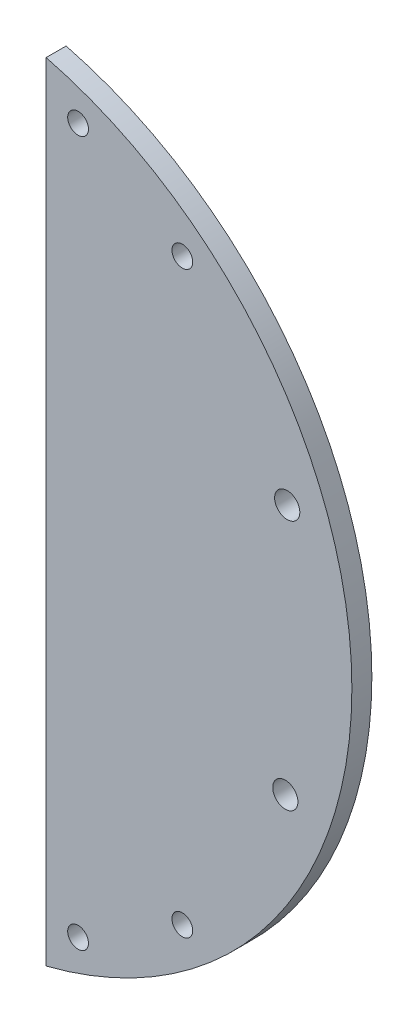
ISO-10303-21;
HEADER;
FILE_DESCRIPTION(('STEP AP214'),'2;1');
FILE_NAME('part.step','',(''),(''),'','','');
FILE_SCHEMA(('AUTOMOTIVE_DESIGN { 1 0 10303 214 1 1 1 1 }'));
ENDSEC;
DATA;
#1=APPLICATION_CONTEXT('core data for automotive mechanical design processes');
#2=APPLICATION_PROTOCOL_DEFINITION('international standard','automotive_design',2000,#1);
#3=PRODUCT_CONTEXT('',#1,'mechanical');
#4=PRODUCT('Part','Part','',(#3));
#5=PRODUCT_RELATED_PRODUCT_CATEGORY('part','',(#4));
#6=PRODUCT_DEFINITION_FORMATION('','',#4);
#7=PRODUCT_DEFINITION_CONTEXT('part definition',#1,'design');
#8=PRODUCT_DEFINITION('design','',#6,#7);
#9=PRODUCT_DEFINITION_SHAPE('','',#8);
#10=(LENGTH_UNIT() NAMED_UNIT(*) SI_UNIT(.MILLI.,.METRE.));
#11=(NAMED_UNIT(*) PLANE_ANGLE_UNIT() SI_UNIT($,.RADIAN.));
#12=(NAMED_UNIT(*) SI_UNIT($,.STERADIAN.) SOLID_ANGLE_UNIT());
#13=UNCERTAINTY_MEASURE_WITH_UNIT(LENGTH_MEASURE(1.E-05),#10,'distance_accuracy_value','');
#14=(GEOMETRIC_REPRESENTATION_CONTEXT(3) GLOBAL_UNCERTAINTY_ASSIGNED_CONTEXT((#13)) GLOBAL_UNIT_ASSIGNED_CONTEXT((#10,
#11,#12)) REPRESENTATION_CONTEXT('',''));
#15=CARTESIAN_POINT('',(0.,0.,0.));
#16=DIRECTION('',(0.,0.,1.));
#17=DIRECTION('',(1.,0.,0.));
#18=AXIS2_PLACEMENT_3D('',#15,#16,#17);
#19=CARTESIAN_POINT('',(-15.925,-0.366425757688034,3.175));
#20=DIRECTION('',(0.,0.,1.));
#21=DIRECTION('',(1.,0.,0.));
#22=AXIS2_PLACEMENT_3D('',#19,#20,#21);
#23=PLANE('',#22);
#24=CARTESIAN_POINT('',(5.075,55.633574242312,3.175));
#25=DIRECTION('',(0.,0.,1.));
#26=DIRECTION('',(-1.,0.,0.));
#27=AXIS2_PLACEMENT_3D('',#24,#25,#26);
#28=CIRCLE('',#27,1.65);
#29=CARTESIAN_POINT('',(3.425,55.633574242312,3.175));
#30=VERTEX_POINT('',#29);
#31=EDGE_CURVE('E96',#30,#30,#28,.T.);
#32=ORIENTED_EDGE('',*,*,#31,.F.);
#33=EDGE_LOOP('',(#32));
#34=FACE_BOUND('',#33,.T.);
#35=CARTESIAN_POINT('',(21.6384711955131,-46.366425757688,3.175));
#36=DIRECTION('',(0.,0.,1.));
#37=DIRECTION('',(1.,0.,0.));
#38=AXIS2_PLACEMENT_3D('',#35,#36,#37);
#39=CIRCLE('',#38,1.65);
#40=CARTESIAN_POINT('',(23.2884711955131,-46.366425757688,3.175));
#41=VERTEX_POINT('',#40);
#42=EDGE_CURVE('E84',#41,#41,#39,.T.);
#43=ORIENTED_EDGE('',*,*,#42,.F.);
#44=EDGE_LOOP('',(#43));
#45=FACE_BOUND('',#44,.T.);
#46=CARTESIAN_POINT('',(38.,-20.2872222283984,3.175));
#47=DIRECTION('',(0.,0.,1.));
#48=DIRECTION('',(1.,0.,0.));
#49=AXIS2_PLACEMENT_3D('',#46,#47,#48);
#50=CIRCLE('',#49,2.);
#51=CARTESIAN_POINT('',(40.,-20.2872222283984,3.175));
#52=VERTEX_POINT('',#51);
#53=EDGE_CURVE('E70',#52,#52,#50,.T.);
#54=ORIENTED_EDGE('',*,*,#53,.F.);
#55=EDGE_LOOP('',(#54));
#56=FACE_BOUND('',#55,.T.);
#57=CARTESIAN_POINT('',(-15.925,-0.366425757688034,3.175));
#58=DIRECTION('',(0.,0.,1.));
#59=DIRECTION('',(1.,0.,0.));
#60=AXIS2_PLACEMENT_3D('',#57,#58,#59);
#61=CIRCLE('',#60,64.5);
#62=CARTESIAN_POINT('',(0.,-62.8695806780598,3.175));
#63=VERTEX_POINT('',#62);
#64=CARTESIAN_POINT('',(0.,62.1367291626838,3.175));
#65=VERTEX_POINT('',#64);
#66=EDGE_CURVE('E64',#63,#65,#61,.T.);
#67=ORIENTED_EDGE('',*,*,#66,.T.);
#68=DIRECTION('',(0.,-1.,0.));
#69=VECTOR('',#68,1.);
#70=CARTESIAN_POINT('',(0.,62.1367291626838,3.175));
#71=LINE('',#70,#69);
#72=EDGE_CURVE('E49',#65,#63,#71,.T.);
#73=ORIENTED_EDGE('',*,*,#72,.T.);
#74=EDGE_LOOP('',(#67,#73));
#75=FACE_BOUND('',#74,.T.);
#76=CARTESIAN_POINT('',(38.3017316170882,19.7116397308029,3.175));
#77=DIRECTION('',(0.,0.,1.));
#78=DIRECTION('',(-1.,0.,0.));
#79=AXIS2_PLACEMENT_3D('',#76,#77,#78);
#80=CIRCLE('',#79,1.99999999999999);
#81=CARTESIAN_POINT('',(36.3017316170882,19.7116397308029,3.175));
#82=VERTEX_POINT('',#81);
#83=EDGE_CURVE('E79',#82,#82,#80,.T.);
#84=ORIENTED_EDGE('',*,*,#83,.F.);
#85=EDGE_LOOP('',(#84));
#86=FACE_BOUND('',#85,.T.);
#87=CARTESIAN_POINT('',(5.07500000000001,-56.366425757688,3.175));
#88=DIRECTION('',(0.,0.,1.));
#89=DIRECTION('',(1.,0.,0.));
#90=AXIS2_PLACEMENT_3D('',#87,#88,#89);
#91=CIRCLE('',#90,1.65);
#92=CARTESIAN_POINT('',(6.72500000000001,-56.366425757688,3.175));
#93=VERTEX_POINT('',#92);
#94=EDGE_CURVE('E90',#93,#93,#91,.T.);
#95=ORIENTED_EDGE('',*,*,#94,.F.);
#96=EDGE_LOOP('',(#95));
#97=FACE_BOUND('',#96,.T.);
#98=CARTESIAN_POINT('',(21.6384711955131,45.633574242312,3.175));
#99=DIRECTION('',(0.,0.,1.));
#100=DIRECTION('',(-1.,0.,0.));
#101=AXIS2_PLACEMENT_3D('',#98,#99,#100);
#102=CIRCLE('',#101,1.65);
#103=CARTESIAN_POINT('',(19.9884711955131,45.633574242312,3.175));
#104=VERTEX_POINT('',#103);
#105=EDGE_CURVE('E102',#104,#104,#102,.T.);
#106=ORIENTED_EDGE('',*,*,#105,.F.);
#107=EDGE_LOOP('',(#106));
#108=FACE_BOUND('',#107,.T.);
#109=ADVANCED_FACE('F33',(#34,#45,#56,#75,#86,#97,#108),#23,.T.);
#110=CARTESIAN_POINT('',(-15.925,-0.366425757688034,0.));
#111=DIRECTION('',(0.,0.,1.));
#112=DIRECTION('',(1.,0.,0.));
#113=AXIS2_PLACEMENT_3D('',#110,#111,#112);
#114=PLANE('',#113);
#115=CARTESIAN_POINT('',(-15.925,-0.366425757688034,0.));
#116=DIRECTION('',(0.,0.,1.));
#117=DIRECTION('',(1.,0.,0.));
#118=AXIS2_PLACEMENT_3D('',#115,#116,#117);
#119=CIRCLE('',#118,64.5);
#120=CARTESIAN_POINT('',(0.,-62.8695806780598,0.));
#121=VERTEX_POINT('',#120);
#122=CARTESIAN_POINT('',(0.,62.1367291626838,0.));
#123=VERTEX_POINT('',#122);
#124=EDGE_CURVE('E65',#121,#123,#119,.T.);
#125=ORIENTED_EDGE('',*,*,#124,.F.);
#126=DIRECTION('',(0.,-1.,0.));
#127=VECTOR('',#126,1.);
#128=CARTESIAN_POINT('',(0.,62.1367291626838,0.));
#129=LINE('',#128,#127);
#130=EDGE_CURVE('E57',#123,#121,#129,.T.);
#131=ORIENTED_EDGE('',*,*,#130,.F.);
#132=EDGE_LOOP('',(#125,#131));
#133=FACE_BOUND('',#132,.T.);
#134=CARTESIAN_POINT('',(38.,-20.2872222283984,0.));
#135=DIRECTION('',(0.,0.,1.));
#136=DIRECTION('',(1.,0.,0.));
#137=AXIS2_PLACEMENT_3D('',#134,#135,#136);
#138=CIRCLE('',#137,2.);
#139=CARTESIAN_POINT('',(40.,-20.2872222283984,0.));
#140=VERTEX_POINT('',#139);
#141=EDGE_CURVE('E73',#140,#140,#138,.T.);
#142=ORIENTED_EDGE('',*,*,#141,.T.);
#143=EDGE_LOOP('',(#142));
#144=FACE_BOUND('',#143,.T.);
#145=CARTESIAN_POINT('',(38.3017316170882,19.7116397308029,0.));
#146=DIRECTION('',(0.,0.,1.));
#147=DIRECTION('',(-1.,0.,0.));
#148=AXIS2_PLACEMENT_3D('',#145,#146,#147);
#149=CIRCLE('',#148,1.99999999999999);
#150=CARTESIAN_POINT('',(36.3017316170882,19.7116397308029,0.));
#151=VERTEX_POINT('',#150);
#152=EDGE_CURVE('E81',#151,#151,#149,.T.);
#153=ORIENTED_EDGE('',*,*,#152,.T.);
#154=EDGE_LOOP('',(#153));
#155=FACE_BOUND('',#154,.T.);
#156=CARTESIAN_POINT('',(21.6384711955131,-46.366425757688,0.));
#157=DIRECTION('',(0.,0.,1.));
#158=DIRECTION('',(1.,0.,0.));
#159=AXIS2_PLACEMENT_3D('',#156,#157,#158);
#160=CIRCLE('',#159,1.65);
#161=CARTESIAN_POINT('',(23.2884711955131,-46.366425757688,0.));
#162=VERTEX_POINT('',#161);
#163=EDGE_CURVE('E87',#162,#162,#160,.T.);
#164=ORIENTED_EDGE('',*,*,#163,.T.);
#165=EDGE_LOOP('',(#164));
#166=FACE_BOUND('',#165,.T.);
#167=CARTESIAN_POINT('',(5.07500000000001,-56.366425757688,0.));
#168=DIRECTION('',(0.,0.,1.));
#169=DIRECTION('',(1.,0.,0.));
#170=AXIS2_PLACEMENT_3D('',#167,#168,#169);
#171=CIRCLE('',#170,1.65);
#172=CARTESIAN_POINT('',(6.72500000000001,-56.366425757688,0.));
#173=VERTEX_POINT('',#172);
#174=EDGE_CURVE('E93',#173,#173,#171,.T.);
#175=ORIENTED_EDGE('',*,*,#174,.T.);
#176=EDGE_LOOP('',(#175));
#177=FACE_BOUND('',#176,.T.);
#178=CARTESIAN_POINT('',(5.075,55.633574242312,0.));
#179=DIRECTION('',(0.,0.,1.));
#180=DIRECTION('',(-1.,0.,0.));
#181=AXIS2_PLACEMENT_3D('',#178,#179,#180);
#182=CIRCLE('',#181,1.65);
#183=CARTESIAN_POINT('',(3.425,55.633574242312,0.));
#184=VERTEX_POINT('',#183);
#185=EDGE_CURVE('E99',#184,#184,#182,.T.);
#186=ORIENTED_EDGE('',*,*,#185,.T.);
#187=EDGE_LOOP('',(#186));
#188=FACE_BOUND('',#187,.T.);
#189=CARTESIAN_POINT('',(21.6384711955131,45.633574242312,0.));
#190=DIRECTION('',(0.,0.,1.));
#191=DIRECTION('',(-1.,0.,0.));
#192=AXIS2_PLACEMENT_3D('',#189,#190,#191);
#193=CIRCLE('',#192,1.65);
#194=CARTESIAN_POINT('',(19.9884711955131,45.633574242312,0.));
#195=VERTEX_POINT('',#194);
#196=EDGE_CURVE('E105',#195,#195,#193,.T.);
#197=ORIENTED_EDGE('',*,*,#196,.T.);
#198=EDGE_LOOP('',(#197));
#199=FACE_BOUND('',#198,.T.);
#200=ADVANCED_FACE('F68',(#133,#144,#155,#166,#177,#188,#199),#114,.F.);
#201=CARTESIAN_POINT('',(-15.925,-0.366425757688034,3.175));
#202=DIRECTION('',(0.,0.,-1.));
#203=DIRECTION('',(-1.,0.,0.));
#204=AXIS2_PLACEMENT_3D('',#201,#202,#203);
#205=CYLINDRICAL_SURFACE('',#204,64.5);
#206=ORIENTED_EDGE('',*,*,#124,.T.);
#207=DIRECTION('',(0.,0.,-1.));
#208=VECTOR('',#207,1.);
#209=CARTESIAN_POINT('',(0.,62.1367291626838,3.175));
#210=LINE('',#209,#208);
#211=EDGE_CURVE('E11',#65,#123,#210,.T.);
#212=ORIENTED_EDGE('',*,*,#211,.F.);
#213=ORIENTED_EDGE('',*,*,#66,.F.);
#214=DIRECTION('',(0.,0.,-1.));
#215=VECTOR('',#214,1.);
#216=CARTESIAN_POINT('',(0.,-62.8695806780598,3.175));
#217=LINE('',#216,#215);
#218=EDGE_CURVE('E42',#63,#121,#217,.T.);
#219=ORIENTED_EDGE('',*,*,#218,.T.);
#220=EDGE_LOOP('',(#206,#212,#213,#219));
#221=FACE_BOUND('',#220,.T.);
#222=ADVANCED_FACE('F35',(#221),#205,.T.);
#223=CARTESIAN_POINT('',(0.,62.1367291626838,3.175));
#224=DIRECTION('',(1.,0.,0.));
#225=DIRECTION('',(0.,0.,-1.));
#226=AXIS2_PLACEMENT_3D('',#223,#224,#225);
#227=PLANE('',#226);
#228=ORIENTED_EDGE('',*,*,#130,.T.);
#229=ORIENTED_EDGE('',*,*,#218,.F.);
#230=ORIENTED_EDGE('',*,*,#72,.F.);
#231=ORIENTED_EDGE('',*,*,#211,.T.);
#232=EDGE_LOOP('',(#228,#229,#230,#231));
#233=FACE_BOUND('',#232,.T.);
#234=ADVANCED_FACE('F60',(#233),#227,.F.);
#235=CARTESIAN_POINT('',(38.,-20.2872222283984,3.175));
#236=DIRECTION('',(0.,0.,-1.));
#237=DIRECTION('',(-1.,0.,0.));
#238=AXIS2_PLACEMENT_3D('',#235,#236,#237);
#239=CYLINDRICAL_SURFACE('',#238,2.);
#240=ORIENTED_EDGE('',*,*,#53,.T.);
#241=EDGE_LOOP('',(#240));
#242=FACE_BOUND('',#241,.T.);
#243=ORIENTED_EDGE('',*,*,#141,.F.);
#244=EDGE_LOOP('',(#243));
#245=FACE_BOUND('',#244,.T.);
#246=ADVANCED_FACE('F124',(#242,#245),#239,.F.);
#247=CARTESIAN_POINT('',(38.3017316170882,19.7116397308029,3.175));
#248=DIRECTION('',(0.,0.,-1.));
#249=DIRECTION('',(-1.,0.,0.));
#250=AXIS2_PLACEMENT_3D('',#247,#248,#249);
#251=CYLINDRICAL_SURFACE('',#250,1.99999999999999);
#252=ORIENTED_EDGE('',*,*,#83,.T.);
#253=EDGE_LOOP('',(#252));
#254=FACE_BOUND('',#253,.T.);
#255=ORIENTED_EDGE('',*,*,#152,.F.);
#256=EDGE_LOOP('',(#255));
#257=FACE_BOUND('',#256,.T.);
#258=ADVANCED_FACE('F131',(#254,#257),#251,.F.);
#259=CARTESIAN_POINT('',(21.6384711955131,-46.366425757688,3.175));
#260=DIRECTION('',(0.,0.,-1.));
#261=DIRECTION('',(-1.,0.,0.));
#262=AXIS2_PLACEMENT_3D('',#259,#260,#261);
#263=CYLINDRICAL_SURFACE('',#262,1.65);
#264=ORIENTED_EDGE('',*,*,#42,.T.);
#265=EDGE_LOOP('',(#264));
#266=FACE_BOUND('',#265,.T.);
#267=ORIENTED_EDGE('',*,*,#163,.F.);
#268=EDGE_LOOP('',(#267));
#269=FACE_BOUND('',#268,.T.);
#270=ADVANCED_FACE('F164',(#266,#269),#263,.F.);
#271=CARTESIAN_POINT('',(5.07500000000001,-56.366425757688,3.175));
#272=DIRECTION('',(0.,0.,-1.));
#273=DIRECTION('',(-1.,0.,0.));
#274=AXIS2_PLACEMENT_3D('',#271,#272,#273);
#275=CYLINDRICAL_SURFACE('',#274,1.65);
#276=ORIENTED_EDGE('',*,*,#94,.T.);
#277=EDGE_LOOP('',(#276));
#278=FACE_BOUND('',#277,.T.);
#279=ORIENTED_EDGE('',*,*,#174,.F.);
#280=EDGE_LOOP('',(#279));
#281=FACE_BOUND('',#280,.T.);
#282=ADVANCED_FACE('F172',(#278,#281),#275,.F.);
#283=CARTESIAN_POINT('',(5.075,55.633574242312,3.175));
#284=DIRECTION('',(0.,0.,-1.));
#285=DIRECTION('',(-1.,0.,0.));
#286=AXIS2_PLACEMENT_3D('',#283,#284,#285);
#287=CYLINDRICAL_SURFACE('',#286,1.65);
#288=ORIENTED_EDGE('',*,*,#31,.T.);
#289=EDGE_LOOP('',(#288));
#290=FACE_BOUND('',#289,.T.);
#291=ORIENTED_EDGE('',*,*,#185,.F.);
#292=EDGE_LOOP('',(#291));
#293=FACE_BOUND('',#292,.T.);
#294=ADVANCED_FACE('F181',(#290,#293),#287,.F.);
#295=CARTESIAN_POINT('',(21.6384711955131,45.633574242312,3.175));
#296=DIRECTION('',(0.,0.,-1.));
#297=DIRECTION('',(-1.,0.,0.));
#298=AXIS2_PLACEMENT_3D('',#295,#296,#297);
#299=CYLINDRICAL_SURFACE('',#298,1.65);
#300=ORIENTED_EDGE('',*,*,#105,.T.);
#301=EDGE_LOOP('',(#300));
#302=FACE_BOUND('',#301,.T.);
#303=ORIENTED_EDGE('',*,*,#196,.F.);
#304=EDGE_LOOP('',(#303));
#305=FACE_BOUND('',#304,.T.);
#306=ADVANCED_FACE('F111',(#302,#305),#299,.F.);
#307=CLOSED_SHELL('',(#109,#200,#222,#234,#246,#258,#270,#282,#294,#306));
#308=MANIFOLD_SOLID_BREP('B2',#307);
#309=ADVANCED_BREP_SHAPE_REPRESENTATION('',(#18,#308),#14);
#310=SHAPE_DEFINITION_REPRESENTATION(#9,#309);
ENDSEC;
END-ISO-10303-21;
